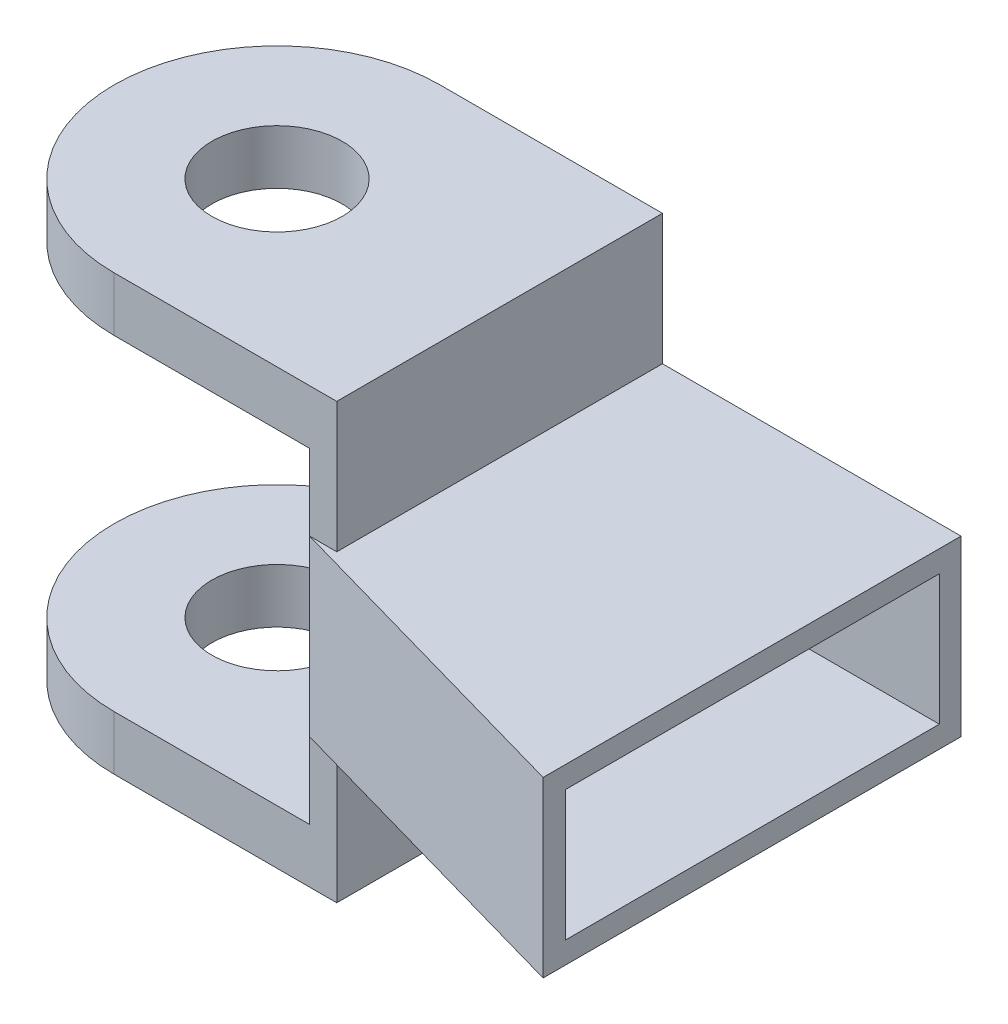
ISO-10303-21;
HEADER;
FILE_DESCRIPTION(('STEP AP214'),'2;1');
FILE_NAME('part.step','',(''),(''),'','','');
FILE_SCHEMA(('AUTOMOTIVE_DESIGN { 1 0 10303 214 1 1 1 1 }'));
ENDSEC;
DATA;
#1=APPLICATION_CONTEXT('core data for automotive mechanical design processes');
#2=APPLICATION_PROTOCOL_DEFINITION('international standard','automotive_design',2000,#1);
#3=PRODUCT_CONTEXT('',#1,'mechanical');
#4=PRODUCT('Part','Part','',(#3));
#5=PRODUCT_RELATED_PRODUCT_CATEGORY('part','',(#4));
#6=PRODUCT_DEFINITION_FORMATION('','',#4);
#7=PRODUCT_DEFINITION_CONTEXT('part definition',#1,'design');
#8=PRODUCT_DEFINITION('design','',#6,#7);
#9=PRODUCT_DEFINITION_SHAPE('','',#8);
#10=(LENGTH_UNIT() NAMED_UNIT(*) SI_UNIT(.MILLI.,.METRE.));
#11=(NAMED_UNIT(*) PLANE_ANGLE_UNIT() SI_UNIT($,.RADIAN.));
#12=(NAMED_UNIT(*) SI_UNIT($,.STERADIAN.) SOLID_ANGLE_UNIT());
#13=UNCERTAINTY_MEASURE_WITH_UNIT(LENGTH_MEASURE(1.E-05),#10,'distance_accuracy_value','');
#14=(GEOMETRIC_REPRESENTATION_CONTEXT(3) GLOBAL_UNCERTAINTY_ASSIGNED_CONTEXT((#13)) GLOBAL_UNIT_ASSIGNED_CONTEXT((#10,
#11,#12)) REPRESENTATION_CONTEXT('',''));
#15=CARTESIAN_POINT('',(0.,0.,0.));
#16=DIRECTION('',(0.,0.,1.));
#17=DIRECTION('',(1.,0.,0.));
#18=AXIS2_PLACEMENT_3D('',#15,#16,#17);
#19=CARTESIAN_POINT('',(-350.,16.,-31.0082296544966));
#20=DIRECTION('',(1.,0.,0.));
#21=DIRECTION('',(0.,0.,-1.));
#22=AXIS2_PLACEMENT_3D('',#19,#20,#21);
#23=PLANE('',#22);
#24=DIRECTION('',(0.,0.,-1.));
#25=VECTOR('',#24,1.);
#26=CARTESIAN_POINT('',(-350.,-7.,0.));
#27=LINE('',#26,#25);
#28=CARTESIAN_POINT('',(-350.,-7.,-31.0082296544966));
#29=VERTEX_POINT('',#28);
#30=CARTESIAN_POINT('',(-350.,-7.,-61.0082296544966));
#31=VERTEX_POINT('',#30);
#32=EDGE_CURVE('E175',#29,#31,#27,.T.);
#33=ORIENTED_EDGE('',*,*,#32,.F.);
#34=DIRECTION('',(0.,-1.,0.));
#35=VECTOR('',#34,1.);
#36=CARTESIAN_POINT('',(-350.,-12.,-31.0082296544966));
#37=LINE('',#36,#35);
#38=CARTESIAN_POINT('',(-350.,0.,-31.0082296544966));
#39=VERTEX_POINT('',#38);
#40=EDGE_CURVE('E190',#39,#29,#37,.T.);
#41=ORIENTED_EDGE('',*,*,#40,.F.);
#42=DIRECTION('',(0.,-1.,0.));
#43=VECTOR('',#42,1.);
#44=CARTESIAN_POINT('',(-350.,16.,-31.0082296544966));
#45=LINE('',#44,#43);
#46=CARTESIAN_POINT('',(-350.,16.,-31.0082296544966));
#47=VERTEX_POINT('',#46);
#48=EDGE_CURVE('E11',#47,#39,#45,.T.);
#49=ORIENTED_EDGE('',*,*,#48,.F.);
#50=DIRECTION('',(0.,1.,0.));
#51=VECTOR('',#50,1.);
#52=CARTESIAN_POINT('',(-350.,28.,-31.0082296544966));
#53=LINE('',#52,#51);
#54=CARTESIAN_POINT('',(-350.,23.,-31.0082296544966));
#55=VERTEX_POINT('',#54);
#56=EDGE_CURVE('E264',#47,#55,#53,.T.);
#57=ORIENTED_EDGE('',*,*,#56,.T.);
#58=DIRECTION('',(0.,0.,-1.));
#59=VECTOR('',#58,1.);
#60=CARTESIAN_POINT('',(-350.,23.,-61.0082296544966));
#61=LINE('',#60,#59);
#62=CARTESIAN_POINT('',(-350.,23.,-61.0082296544966));
#63=VERTEX_POINT('',#62);
#64=EDGE_CURVE('E238',#55,#63,#61,.T.);
#65=ORIENTED_EDGE('',*,*,#64,.T.);
#66=DIRECTION('',(0.,-1.,0.));
#67=VECTOR('',#66,1.);
#68=CARTESIAN_POINT('',(-350.,16.,-61.0082296544966));
#69=LINE('',#68,#67);
#70=EDGE_CURVE('E350',#63,#31,#69,.T.);
#71=ORIENTED_EDGE('',*,*,#70,.T.);
#72=EDGE_LOOP('',(#33,#41,#49,#57,#65,#71));
#73=FACE_BOUND('',#72,.T.);
#74=ADVANCED_FACE('F41',(#73),#23,.F.);
#75=CARTESIAN_POINT('',(-320.,16.,-61.0082296544966));
#76=DIRECTION('',(-1.,0.,0.));
#77=DIRECTION('',(0.,0.,1.));
#78=AXIS2_PLACEMENT_3D('',#75,#76,#77);
#79=PLANE('',#78);
#80=DIRECTION('',(0.,0.,-1.));
#81=VECTOR('',#80,1.);
#82=CARTESIAN_POINT('',(-320.,0.,-61.0082296544966));
#83=LINE('',#82,#81);
#84=CARTESIAN_POINT('',(-320.,0.,-22.5144026413586));
#85=VERTEX_POINT('',#84);
#86=CARTESIAN_POINT('',(-320.,0.,-61.0082296544966));
#87=VERTEX_POINT('',#86);
#88=EDGE_CURVE('E353',#85,#87,#83,.T.);
#89=ORIENTED_EDGE('',*,*,#88,.T.);
#90=DIRECTION('',(0.,-1.,0.));
#91=VECTOR('',#90,1.);
#92=CARTESIAN_POINT('',(-320.,16.,-61.0082296544966));
#93=LINE('',#92,#91);
#94=CARTESIAN_POINT('',(-320.,16.,-61.0082296544966));
#95=VERTEX_POINT('',#94);
#96=EDGE_CURVE('E361',#95,#87,#93,.T.);
#97=ORIENTED_EDGE('',*,*,#96,.F.);
#98=DIRECTION('',(0.,0.,-1.));
#99=VECTOR('',#98,1.);
#100=CARTESIAN_POINT('',(-320.,16.,-61.0082296544966));
#101=LINE('',#100,#99);
#102=CARTESIAN_POINT('',(-320.,16.,-22.5144026413586));
#103=VERTEX_POINT('',#102);
#104=EDGE_CURVE('E342',#103,#95,#101,.T.);
#105=ORIENTED_EDGE('',*,*,#104,.F.);
#106=DIRECTION('',(0.,-1.,0.));
#107=VECTOR('',#106,1.);
#108=CARTESIAN_POINT('',(-320.,16.,-22.5144026413586));
#109=LINE('',#108,#107);
#110=EDGE_CURVE('E49',#103,#85,#109,.T.);
#111=ORIENTED_EDGE('',*,*,#110,.T.);
#112=EDGE_LOOP('',(#89,#97,#105,#111));
#113=FACE_BOUND('',#112,.T.);
#114=DIRECTION('',(0.,0.,-1.));
#115=VECTOR('',#114,1.);
#116=CARTESIAN_POINT('',(-320.,2.,0.));
#117=LINE('',#116,#115);
#118=CARTESIAN_POINT('',(-320.,2.,-24.5930187379522));
#119=VERTEX_POINT('',#118);
#120=CARTESIAN_POINT('',(-320.,2.,-59.0082296544966));
#121=VERTEX_POINT('',#120);
#122=EDGE_CURVE('E319',#119,#121,#117,.T.);
#123=ORIENTED_EDGE('',*,*,#122,.F.);
#124=DIRECTION('',(0.,-1.,0.));
#125=VECTOR('',#124,1.);
#126=CARTESIAN_POINT('',(-320.,16.,-24.5930187379522));
#127=LINE('',#126,#125);
#128=CARTESIAN_POINT('',(-320.,14.,-24.5930187379522));
#129=VERTEX_POINT('',#128);
#130=EDGE_CURVE('E304',#129,#119,#127,.T.);
#131=ORIENTED_EDGE('',*,*,#130,.F.);
#132=DIRECTION('',(0.,0.,-1.));
#133=VECTOR('',#132,1.);
#134=CARTESIAN_POINT('',(-320.,14.,0.));
#135=LINE('',#134,#133);
#136=CARTESIAN_POINT('',(-320.,14.,-59.0082296544966));
#137=VERTEX_POINT('',#136);
#138=EDGE_CURVE('E323',#129,#137,#135,.T.);
#139=ORIENTED_EDGE('',*,*,#138,.T.);
#140=DIRECTION('',(0.,-1.,0.));
#141=VECTOR('',#140,1.);
#142=CARTESIAN_POINT('',(-320.,16.,-59.0082296544966));
#143=LINE('',#142,#141);
#144=EDGE_CURVE('E315',#137,#121,#143,.T.);
#145=ORIENTED_EDGE('',*,*,#144,.T.);
#146=EDGE_LOOP('',(#123,#131,#139,#145));
#147=FACE_BOUND('',#146,.T.);
#148=ADVANCED_FACE('F370',(#113,#147),#79,.F.);
#149=CARTESIAN_POINT('',(-350.,16.,-31.0082296544966));
#150=DIRECTION('',(0.272419296250593,0.,-0.962178635717054));
#151=DIRECTION('',(-0.962178635717054,0.,-0.272419296250593));
#152=AXIS2_PLACEMENT_3D('',#149,#150,#151);
#153=PLANE('',#152);
#154=DIRECTION('',(0.962178635717054,0.,0.272419296250593));
#155=VECTOR('',#154,1.);
#156=CARTESIAN_POINT('',(-350.,0.,-31.0082296544966));
#157=LINE('',#156,#155);
#158=EDGE_CURVE('E303',#39,#85,#157,.T.);
#159=ORIENTED_EDGE('',*,*,#158,.T.);
#160=ORIENTED_EDGE('',*,*,#110,.F.);
#161=DIRECTION('',(0.962178635717054,0.,0.272419296250593));
#162=VECTOR('',#161,1.);
#163=CARTESIAN_POINT('',(-350.,16.,-31.0082296544966));
#164=LINE('',#163,#162);
#165=EDGE_CURVE('E339',#47,#103,#164,.T.);
#166=ORIENTED_EDGE('',*,*,#165,.F.);
#167=ORIENTED_EDGE('',*,*,#48,.T.);
#168=EDGE_LOOP('',(#159,#160,#166,#167));
#169=FACE_BOUND('',#168,.T.);
#170=ADVANCED_FACE('F411',(#169),#153,.F.);
#171=CARTESIAN_POINT('',(-350.,16.,-61.0082296544966));
#172=DIRECTION('',(0.,0.,1.));
#173=DIRECTION('',(1.,0.,0.));
#174=AXIS2_PLACEMENT_3D('',#171,#172,#173);
#175=PLANE('',#174);
#176=DIRECTION('',(-1.,0.,0.));
#177=VECTOR('',#176,1.);
#178=CARTESIAN_POINT('',(-350.,0.,-61.0082296544966));
#179=LINE('',#178,#177);
#180=CARTESIAN_POINT('',(-347.5,0.,-61.0082296544966));
#181=VERTEX_POINT('',#180);
#182=EDGE_CURVE('E343',#87,#181,#179,.T.);
#183=ORIENTED_EDGE('',*,*,#182,.T.);
#184=DIRECTION('',(0.,1.,0.));
#185=VECTOR('',#184,1.);
#186=CARTESIAN_POINT('',(-347.5,0.,-61.0082296544966));
#187=LINE('',#186,#185);
#188=CARTESIAN_POINT('',(-347.5,-12.,-61.0082296544966));
#189=VERTEX_POINT('',#188);
#190=EDGE_CURVE('E212',#189,#181,#187,.T.);
#191=ORIENTED_EDGE('',*,*,#190,.F.);
#192=DIRECTION('',(-1.,0.,0.));
#193=VECTOR('',#192,1.);
#194=CARTESIAN_POINT('',(-347.5,-12.,-61.0082296544966));
#195=LINE('',#194,#193);
#196=CARTESIAN_POINT('',(-368.,-12.,-61.0082296544966));
#197=VERTEX_POINT('',#196);
#198=EDGE_CURVE('E222',#189,#197,#195,.T.);
#199=ORIENTED_EDGE('',*,*,#198,.T.);
#200=DIRECTION('',(0.,-1.,0.));
#201=VECTOR('',#200,1.);
#202=CARTESIAN_POINT('',(-368.,-7.,-61.0082296544966));
#203=LINE('',#202,#201);
#204=CARTESIAN_POINT('',(-368.,-7.,-61.0082296544966));
#205=VERTEX_POINT('',#204);
#206=EDGE_CURVE('E174',#205,#197,#203,.T.);
#207=ORIENTED_EDGE('',*,*,#206,.F.);
#208=DIRECTION('',(-1.,0.,0.));
#209=VECTOR('',#208,1.);
#210=CARTESIAN_POINT('',(0.,-7.,-61.0082296544966));
#211=LINE('',#210,#209);
#212=EDGE_CURVE('E182',#31,#205,#211,.T.);
#213=ORIENTED_EDGE('',*,*,#212,.F.);
#214=ORIENTED_EDGE('',*,*,#70,.F.);
#215=DIRECTION('',(-1.,0.,0.));
#216=VECTOR('',#215,1.);
#217=CARTESIAN_POINT('',(-350.,23.,-61.0082296544966));
#218=LINE('',#217,#216);
#219=CARTESIAN_POINT('',(-368.,23.,-61.0082296544966));
#220=VERTEX_POINT('',#219);
#221=EDGE_CURVE('E64',#63,#220,#218,.T.);
#222=ORIENTED_EDGE('',*,*,#221,.T.);
#223=DIRECTION('',(0.,-1.,0.));
#224=VECTOR('',#223,1.);
#225=CARTESIAN_POINT('',(-368.,28.,-61.0082296544966));
#226=LINE('',#225,#224);
#227=CARTESIAN_POINT('',(-368.,28.,-61.0082296544966));
#228=VERTEX_POINT('',#227);
#229=EDGE_CURVE('E260',#228,#220,#226,.T.);
#230=ORIENTED_EDGE('',*,*,#229,.F.);
#231=DIRECTION('',(-1.,0.,0.));
#232=VECTOR('',#231,1.);
#233=CARTESIAN_POINT('',(-347.5,28.,-61.0082296544966));
#234=LINE('',#233,#232);
#235=CARTESIAN_POINT('',(-347.5,28.,-61.0082296544966));
#236=VERTEX_POINT('',#235);
#237=EDGE_CURVE('E285',#236,#228,#234,.T.);
#238=ORIENTED_EDGE('',*,*,#237,.F.);
#239=DIRECTION('',(0.,-1.,0.));
#240=VECTOR('',#239,1.);
#241=CARTESIAN_POINT('',(-347.5,16.,-61.0082296544966));
#242=LINE('',#241,#240);
#243=CARTESIAN_POINT('',(-347.5,16.,-61.0082296544966));
#244=VERTEX_POINT('',#243);
#245=EDGE_CURVE('E277',#236,#244,#242,.T.);
#246=ORIENTED_EDGE('',*,*,#245,.T.);
#247=DIRECTION('',(-1.,0.,0.));
#248=VECTOR('',#247,1.);
#249=CARTESIAN_POINT('',(-350.,16.,-61.0082296544966));
#250=LINE('',#249,#248);
#251=EDGE_CURVE('E346',#95,#244,#250,.T.);
#252=ORIENTED_EDGE('',*,*,#251,.F.);
#253=ORIENTED_EDGE('',*,*,#96,.T.);
#254=EDGE_LOOP('',(#183,#191,#199,#207,#213,#214,#222,#230,#238,#246,#252,#253));
#255=FACE_BOUND('',#254,.T.);
#256=ADVANCED_FACE('F378',(#255),#175,.F.);
#257=CARTESIAN_POINT('',(0.,16.,0.));
#258=DIRECTION('',(0.,-1.,0.));
#259=DIRECTION('',(0.,0.,-1.));
#260=AXIS2_PLACEMENT_3D('',#257,#258,#259);
#261=PLANE('',#260);
#262=ORIENTED_EDGE('',*,*,#251,.T.);
#263=DIRECTION('',(0.,0.,1.));
#264=VECTOR('',#263,1.);
#265=CARTESIAN_POINT('',(-347.5,16.,-31.0082296544966));
#266=LINE('',#265,#264);
#267=CARTESIAN_POINT('',(-347.5,16.,-31.0082296544966));
#268=VERTEX_POINT('',#267);
#269=EDGE_CURVE('E265',#244,#268,#266,.T.);
#270=ORIENTED_EDGE('',*,*,#269,.T.);
#271=DIRECTION('',(-1.,0.,0.));
#272=VECTOR('',#271,1.);
#273=CARTESIAN_POINT('',(-347.5,16.,-31.0082296544966));
#274=LINE('',#273,#272);
#275=EDGE_CURVE('E281',#268,#47,#274,.T.);
#276=ORIENTED_EDGE('',*,*,#275,.T.);
#277=ORIENTED_EDGE('',*,*,#165,.T.);
#278=ORIENTED_EDGE('',*,*,#104,.T.);
#279=EDGE_LOOP('',(#262,#270,#276,#277,#278));
#280=FACE_BOUND('',#279,.T.);
#281=ADVANCED_FACE('F410',(#280),#261,.F.);
#282=CARTESIAN_POINT('',(0.,0.,0.));
#283=DIRECTION('',(0.,-1.,0.));
#284=DIRECTION('',(0.,0.,-1.));
#285=AXIS2_PLACEMENT_3D('',#282,#283,#284);
#286=PLANE('',#285);
#287=DIRECTION('',(-1.,0.,0.));
#288=VECTOR('',#287,1.);
#289=CARTESIAN_POINT('',(-347.5,0.,-31.0082296544966));
#290=LINE('',#289,#288);
#291=CARTESIAN_POINT('',(-347.5,0.,-31.0082296544966));
#292=VERTEX_POINT('',#291);
#293=EDGE_CURVE('E225',#292,#39,#290,.T.);
#294=ORIENTED_EDGE('',*,*,#293,.F.);
#295=DIRECTION('',(0.,0.,1.));
#296=VECTOR('',#295,1.);
#297=CARTESIAN_POINT('',(-347.5,0.,-31.0082296544966));
#298=LINE('',#297,#296);
#299=EDGE_CURVE('E56',#181,#292,#298,.T.);
#300=ORIENTED_EDGE('',*,*,#299,.F.);
#301=ORIENTED_EDGE('',*,*,#182,.F.);
#302=ORIENTED_EDGE('',*,*,#88,.F.);
#303=ORIENTED_EDGE('',*,*,#158,.F.);
#304=EDGE_LOOP('',(#294,#300,#301,#302,#303));
#305=FACE_BOUND('',#304,.T.);
#306=ADVANCED_FACE('F375',(#305),#286,.T.);
#307=CARTESIAN_POINT('',(-348.,16.,-31.0082296544966));
#308=DIRECTION('',(1.,0.,0.));
#309=DIRECTION('',(0.,0.,-1.));
#310=AXIS2_PLACEMENT_3D('',#307,#308,#309);
#311=PLANE('',#310);
#312=DIRECTION('',(0.,0.,1.));
#313=VECTOR('',#312,1.);
#314=CARTESIAN_POINT('',(-348.,2.,0.));
#315=LINE('',#314,#313);
#316=CARTESIAN_POINT('',(-348.,2.,-59.0082296544966));
#317=VERTEX_POINT('',#316);
#318=CARTESIAN_POINT('',(-348.,2.,-32.520590616881));
#319=VERTEX_POINT('',#318);
#320=EDGE_CURVE('E288',#317,#319,#315,.T.);
#321=ORIENTED_EDGE('',*,*,#320,.F.);
#322=DIRECTION('',(0.,-1.,0.));
#323=VECTOR('',#322,1.);
#324=CARTESIAN_POINT('',(-348.,16.,-59.0082296544966));
#325=LINE('',#324,#323);
#326=CARTESIAN_POINT('',(-348.,14.,-59.0082296544966));
#327=VERTEX_POINT('',#326);
#328=EDGE_CURVE('E311',#327,#317,#325,.T.);
#329=ORIENTED_EDGE('',*,*,#328,.F.);
#330=DIRECTION('',(0.,0.,1.));
#331=VECTOR('',#330,1.);
#332=CARTESIAN_POINT('',(-348.,14.,0.));
#333=LINE('',#332,#331);
#334=CARTESIAN_POINT('',(-348.,14.,-32.520590616881));
#335=VERTEX_POINT('',#334);
#336=EDGE_CURVE('E305',#327,#335,#333,.T.);
#337=ORIENTED_EDGE('',*,*,#336,.T.);
#338=DIRECTION('',(0.,-1.,0.));
#339=VECTOR('',#338,1.);
#340=CARTESIAN_POINT('',(-348.,16.,-32.520590616881));
#341=LINE('',#340,#339);
#342=EDGE_CURVE('E299',#335,#319,#341,.T.);
#343=ORIENTED_EDGE('',*,*,#342,.T.);
#344=EDGE_LOOP('',(#321,#329,#337,#343));
#345=FACE_BOUND('',#344,.T.);
#346=ADVANCED_FACE('F435',(#345),#311,.T.);
#347=CARTESIAN_POINT('',(-349.455161407499,16.,-32.9325869259307));
#348=DIRECTION('',(0.272419296250593,0.,-0.962178635717054));
#349=DIRECTION('',(-0.962178635717054,0.,-0.272419296250593));
#350=AXIS2_PLACEMENT_3D('',#347,#348,#349);
#351=PLANE('',#350);
#352=DIRECTION('',(0.962178635717054,0.,0.272419296250593));
#353=VECTOR('',#352,1.);
#354=CARTESIAN_POINT('',(-17.3017029914529,2.,61.1092136607835));
#355=LINE('',#354,#353);
#356=EDGE_CURVE('E298',#319,#119,#355,.T.);
#357=ORIENTED_EDGE('',*,*,#356,.F.);
#358=ORIENTED_EDGE('',*,*,#342,.F.);
#359=DIRECTION('',(0.962178635717054,0.,0.272419296250593));
#360=VECTOR('',#359,1.);
#361=CARTESIAN_POINT('',(-17.3017029914529,14.,61.1092136607835));
#362=LINE('',#361,#360);
#363=EDGE_CURVE('E309',#335,#129,#362,.T.);
#364=ORIENTED_EDGE('',*,*,#363,.T.);
#365=ORIENTED_EDGE('',*,*,#130,.T.);
#366=EDGE_LOOP('',(#357,#358,#364,#365));
#367=FACE_BOUND('',#366,.T.);
#368=ADVANCED_FACE('F439',(#367),#351,.T.);
#369=CARTESIAN_POINT('',(-350.,16.,-59.0082296544966));
#370=DIRECTION('',(0.,0.,1.));
#371=DIRECTION('',(1.,0.,0.));
#372=AXIS2_PLACEMENT_3D('',#369,#370,#371);
#373=PLANE('',#372);
#374=DIRECTION('',(-1.,0.,0.));
#375=VECTOR('',#374,1.);
#376=CARTESIAN_POINT('',(0.,2.,-59.0082296544966));
#377=LINE('',#376,#375);
#378=EDGE_CURVE('E310',#121,#317,#377,.T.);
#379=ORIENTED_EDGE('',*,*,#378,.F.);
#380=ORIENTED_EDGE('',*,*,#144,.F.);
#381=DIRECTION('',(-1.,0.,0.));
#382=VECTOR('',#381,1.);
#383=CARTESIAN_POINT('',(0.,14.,-59.0082296544966));
#384=LINE('',#383,#382);
#385=EDGE_CURVE('E316',#137,#327,#384,.T.);
#386=ORIENTED_EDGE('',*,*,#385,.T.);
#387=ORIENTED_EDGE('',*,*,#328,.T.);
#388=EDGE_LOOP('',(#379,#380,#386,#387));
#389=FACE_BOUND('',#388,.T.);
#390=ADVANCED_FACE('F450',(#389),#373,.T.);
#391=CARTESIAN_POINT('',(0.,14.,0.));
#392=DIRECTION('',(0.,-1.,0.));
#393=DIRECTION('',(0.,0.,-1.));
#394=AXIS2_PLACEMENT_3D('',#391,#392,#393);
#395=PLANE('',#394);
#396=ORIENTED_EDGE('',*,*,#336,.F.);
#397=ORIENTED_EDGE('',*,*,#385,.F.);
#398=ORIENTED_EDGE('',*,*,#138,.F.);
#399=ORIENTED_EDGE('',*,*,#363,.F.);
#400=EDGE_LOOP('',(#396,#397,#398,#399));
#401=FACE_BOUND('',#400,.T.);
#402=ADVANCED_FACE('F460',(#401),#395,.T.);
#403=CARTESIAN_POINT('',(0.,2.,0.));
#404=DIRECTION('',(0.,-1.,0.));
#405=DIRECTION('',(0.,0.,-1.));
#406=AXIS2_PLACEMENT_3D('',#403,#404,#405);
#407=PLANE('',#406);
#408=ORIENTED_EDGE('',*,*,#320,.T.);
#409=ORIENTED_EDGE('',*,*,#356,.T.);
#410=ORIENTED_EDGE('',*,*,#122,.T.);
#411=ORIENTED_EDGE('',*,*,#378,.T.);
#412=EDGE_LOOP('',(#408,#409,#410,#411));
#413=FACE_BOUND('',#412,.T.);
#414=ADVANCED_FACE('F470',(#413),#407,.F.);
#415=CARTESIAN_POINT('',(-347.5,28.,-61.0082296544966));
#416=DIRECTION('',(0.,1.,0.));
#417=DIRECTION('',(0.,0.,1.));
#418=AXIS2_PLACEMENT_3D('',#415,#416,#417);
#419=PLANE('',#418);
#420=ORIENTED_EDGE('',*,*,#237,.T.);
#421=CARTESIAN_POINT('',(-368.,28.,-46.0082296544966));
#422=DIRECTION('',(0.,1.,0.));
#423=DIRECTION('',(0.,0.,1.));
#424=AXIS2_PLACEMENT_3D('',#421,#422,#423);
#425=CIRCLE('',#424,15.);
#426=CARTESIAN_POINT('',(-368.,28.,-31.0082296544966));
#427=VERTEX_POINT('',#426);
#428=EDGE_CURVE('E242',#228,#427,#425,.T.);
#429=ORIENTED_EDGE('',*,*,#428,.T.);
#430=DIRECTION('',(-1.,0.,0.));
#431=VECTOR('',#430,1.);
#432=CARTESIAN_POINT('',(-347.5,28.,-31.0082296544966));
#433=LINE('',#432,#431);
#434=CARTESIAN_POINT('',(-347.5,28.,-31.0082296544966));
#435=VERTEX_POINT('',#434);
#436=EDGE_CURVE('E289',#435,#427,#433,.T.);
#437=ORIENTED_EDGE('',*,*,#436,.F.);
#438=DIRECTION('',(0.,0.,-1.));
#439=VECTOR('',#438,1.);
#440=CARTESIAN_POINT('',(-347.5,28.,-61.0082296544966));
#441=LINE('',#440,#439);
#442=EDGE_CURVE('E273',#435,#236,#441,.T.);
#443=ORIENTED_EDGE('',*,*,#442,.T.);
#444=EDGE_LOOP('',(#420,#429,#437,#443));
#445=FACE_BOUND('',#444,.T.);
#446=CARTESIAN_POINT('',(-368.,28.,-46.0082296544966));
#447=DIRECTION('',(0.,1.,0.));
#448=DIRECTION('',(0.,0.,1.));
#449=AXIS2_PLACEMENT_3D('',#446,#447,#448);
#450=CIRCLE('',#449,5.99999999999999);
#451=CARTESIAN_POINT('',(-368.,28.,-40.0082296544966));
#452=VERTEX_POINT('',#451);
#453=EDGE_CURVE('E234',#452,#452,#450,.T.);
#454=ORIENTED_EDGE('',*,*,#453,.F.);
#455=EDGE_LOOP('',(#454));
#456=FACE_BOUND('',#455,.T.);
#457=ADVANCED_FACE('F404',(#445,#456),#419,.T.);
#458=CARTESIAN_POINT('',(-347.5,28.,-31.0082296544966));
#459=DIRECTION('',(0.,0.,1.));
#460=DIRECTION('',(0.,-1.,0.));
#461=AXIS2_PLACEMENT_3D('',#458,#459,#460);
#462=PLANE('',#461);
#463=ORIENTED_EDGE('',*,*,#56,.F.);
#464=ORIENTED_EDGE('',*,*,#275,.F.);
#465=DIRECTION('',(0.,1.,0.));
#466=VECTOR('',#465,1.);
#467=CARTESIAN_POINT('',(-347.5,28.,-31.0082296544966));
#468=LINE('',#467,#466);
#469=EDGE_CURVE('E269',#268,#435,#468,.T.);
#470=ORIENTED_EDGE('',*,*,#469,.T.);
#471=ORIENTED_EDGE('',*,*,#436,.T.);
#472=DIRECTION('',(0.,-1.,0.));
#473=VECTOR('',#472,1.);
#474=CARTESIAN_POINT('',(-368.,28.,-31.0082296544966));
#475=LINE('',#474,#473);
#476=CARTESIAN_POINT('',(-368.,23.,-31.0082296544966));
#477=VERTEX_POINT('',#476);
#478=EDGE_CURVE('E246',#427,#477,#475,.T.);
#479=ORIENTED_EDGE('',*,*,#478,.T.);
#480=DIRECTION('',(1.,0.,0.));
#481=VECTOR('',#480,1.);
#482=CARTESIAN_POINT('',(-350.,23.,-31.0082296544966));
#483=LINE('',#482,#481);
#484=EDGE_CURVE('E247',#477,#55,#483,.T.);
#485=ORIENTED_EDGE('',*,*,#484,.T.);
#486=EDGE_LOOP('',(#463,#464,#470,#471,#479,#485));
#487=FACE_BOUND('',#486,.T.);
#488=ADVANCED_FACE('F395',(#487),#462,.T.);
#489=CARTESIAN_POINT('',(-347.5,0.,0.));
#490=DIRECTION('',(1.,0.,0.));
#491=DIRECTION('',(0.,0.,-1.));
#492=AXIS2_PLACEMENT_3D('',#489,#490,#491);
#493=PLANE('',#492);
#494=ORIENTED_EDGE('',*,*,#269,.F.);
#495=ORIENTED_EDGE('',*,*,#245,.F.);
#496=ORIENTED_EDGE('',*,*,#442,.F.);
#497=ORIENTED_EDGE('',*,*,#469,.F.);
#498=EDGE_LOOP('',(#494,#495,#496,#497));
#499=FACE_BOUND('',#498,.T.);
#500=ADVANCED_FACE('F408',(#499),#493,.T.);
#501=CARTESIAN_POINT('',(-368.,23.,-46.0082296544966));
#502=DIRECTION('',(0.,1.,0.));
#503=DIRECTION('',(0.,0.,1.));
#504=AXIS2_PLACEMENT_3D('',#501,#502,#503);
#505=PLANE('',#504);
#506=ORIENTED_EDGE('',*,*,#64,.F.);
#507=ORIENTED_EDGE('',*,*,#484,.F.);
#508=CARTESIAN_POINT('',(-368.,23.,-46.0082296544966));
#509=DIRECTION('',(0.,1.,0.));
#510=DIRECTION('',(0.,0.,1.));
#511=AXIS2_PLACEMENT_3D('',#508,#509,#510);
#512=CIRCLE('',#511,15.);
#513=EDGE_CURVE('E252',#220,#477,#512,.T.);
#514=ORIENTED_EDGE('',*,*,#513,.F.);
#515=ORIENTED_EDGE('',*,*,#221,.F.);
#516=EDGE_LOOP('',(#506,#507,#514,#515));
#517=FACE_BOUND('',#516,.T.);
#518=CARTESIAN_POINT('',(-368.,23.,-46.0082296544966));
#519=DIRECTION('',(0.,1.,0.));
#520=DIRECTION('',(0.,0.,1.));
#521=AXIS2_PLACEMENT_3D('',#518,#519,#520);
#522=CIRCLE('',#521,5.99999999999999);
#523=CARTESIAN_POINT('',(-368.,23.,-40.0082296544966));
#524=VERTEX_POINT('',#523);
#525=EDGE_CURVE('E228',#524,#524,#522,.T.);
#526=ORIENTED_EDGE('',*,*,#525,.T.);
#527=EDGE_LOOP('',(#526));
#528=FACE_BOUND('',#527,.T.);
#529=ADVANCED_FACE('F392',(#517,#528),#505,.F.);
#530=CARTESIAN_POINT('',(-368.,28.,-46.0082296544966));
#531=DIRECTION('',(0.,-1.,0.));
#532=DIRECTION('',(0.,0.,-1.));
#533=AXIS2_PLACEMENT_3D('',#530,#531,#532);
#534=CYLINDRICAL_SURFACE('',#533,15.);
#535=ORIENTED_EDGE('',*,*,#513,.T.);
#536=ORIENTED_EDGE('',*,*,#478,.F.);
#537=ORIENTED_EDGE('',*,*,#428,.F.);
#538=ORIENTED_EDGE('',*,*,#229,.T.);
#539=EDGE_LOOP('',(#535,#536,#537,#538));
#540=FACE_BOUND('',#539,.T.);
#541=ADVANCED_FACE('F399',(#540),#534,.T.);
#542=CARTESIAN_POINT('',(-368.,28.,-46.0082296544966));
#543=DIRECTION('',(0.,-1.,0.));
#544=DIRECTION('',(0.,0.,-1.));
#545=AXIS2_PLACEMENT_3D('',#542,#543,#544);
#546=CYLINDRICAL_SURFACE('',#545,5.99999999999999);
#547=ORIENTED_EDGE('',*,*,#453,.T.);
#548=EDGE_LOOP('',(#547));
#549=FACE_BOUND('',#548,.T.);
#550=ORIENTED_EDGE('',*,*,#525,.F.);
#551=EDGE_LOOP('',(#550));
#552=FACE_BOUND('',#551,.T.);
#553=ADVANCED_FACE('F534',(#549,#552),#546,.F.);
#554=CARTESIAN_POINT('',(-347.5,-12.,-31.0082296544966));
#555=DIRECTION('',(0.,0.,-1.));
#556=DIRECTION('',(0.,1.,0.));
#557=AXIS2_PLACEMENT_3D('',#554,#555,#556);
#558=PLANE('',#557);
#559=ORIENTED_EDGE('',*,*,#40,.T.);
#560=DIRECTION('',(-1.,0.,0.));
#561=VECTOR('',#560,1.);
#562=CARTESIAN_POINT('',(0.,-7.,-31.0082296544966));
#563=LINE('',#562,#561);
#564=CARTESIAN_POINT('',(-368.,-7.,-31.0082296544966));
#565=VERTEX_POINT('',#564);
#566=EDGE_CURVE('E180',#29,#565,#563,.T.);
#567=ORIENTED_EDGE('',*,*,#566,.T.);
#568=DIRECTION('',(0.,-1.,0.));
#569=VECTOR('',#568,1.);
#570=CARTESIAN_POINT('',(-368.,-7.,-31.0082296544966));
#571=LINE('',#570,#569);
#572=CARTESIAN_POINT('',(-368.,-12.,-31.0082296544966));
#573=VERTEX_POINT('',#572);
#574=EDGE_CURVE('E163',#565,#573,#571,.T.);
#575=ORIENTED_EDGE('',*,*,#574,.T.);
#576=DIRECTION('',(-1.,0.,0.));
#577=VECTOR('',#576,1.);
#578=CARTESIAN_POINT('',(-347.5,-12.,-31.0082296544966));
#579=LINE('',#578,#577);
#580=CARTESIAN_POINT('',(-347.5,-12.,-31.0082296544966));
#581=VERTEX_POINT('',#580);
#582=EDGE_CURVE('E229',#581,#573,#579,.T.);
#583=ORIENTED_EDGE('',*,*,#582,.F.);
#584=DIRECTION('',(0.,-1.,0.));
#585=VECTOR('',#584,1.);
#586=CARTESIAN_POINT('',(-347.5,-12.,-31.0082296544966));
#587=LINE('',#586,#585);
#588=EDGE_CURVE('E219',#292,#581,#587,.T.);
#589=ORIENTED_EDGE('',*,*,#588,.F.);
#590=ORIENTED_EDGE('',*,*,#293,.T.);
#591=EDGE_LOOP('',(#559,#567,#575,#583,#589,#590));
#592=FACE_BOUND('',#591,.T.);
#593=ADVANCED_FACE('F187',(#592),#558,.F.);
#594=CARTESIAN_POINT('',(-347.5,-12.,-61.0082296544966));
#595=DIRECTION('',(0.,1.,0.));
#596=DIRECTION('',(0.,0.,1.));
#597=AXIS2_PLACEMENT_3D('',#594,#595,#596);
#598=PLANE('',#597);
#599=ORIENTED_EDGE('',*,*,#582,.T.);
#600=CARTESIAN_POINT('',(-368.,-12.,-46.0082296544966));
#601=DIRECTION('',(0.,-1.,0.));
#602=DIRECTION('',(0.,0.,-1.));
#603=AXIS2_PLACEMENT_3D('',#600,#601,#602);
#604=CIRCLE('',#603,15.);
#605=EDGE_CURVE('E169',#573,#197,#604,.T.);
#606=ORIENTED_EDGE('',*,*,#605,.T.);
#607=ORIENTED_EDGE('',*,*,#198,.F.);
#608=DIRECTION('',(0.,0.,-1.));
#609=VECTOR('',#608,1.);
#610=CARTESIAN_POINT('',(-347.5,-12.,-61.0082296544966));
#611=LINE('',#610,#609);
#612=EDGE_CURVE('E216',#581,#189,#611,.T.);
#613=ORIENTED_EDGE('',*,*,#612,.F.);
#614=EDGE_LOOP('',(#599,#606,#607,#613));
#615=FACE_BOUND('',#614,.T.);
#616=CARTESIAN_POINT('',(-368.,-12.,-46.0082296544966));
#617=DIRECTION('',(0.,-1.,0.));
#618=DIRECTION('',(0.,0.,-1.));
#619=AXIS2_PLACEMENT_3D('',#616,#617,#618);
#620=CIRCLE('',#619,5.99999999999999);
#621=CARTESIAN_POINT('',(-368.,-12.,-52.0082296544966));
#622=VERTEX_POINT('',#621);
#623=EDGE_CURVE('E202',#622,#622,#620,.T.);
#624=ORIENTED_EDGE('',*,*,#623,.F.);
#625=EDGE_LOOP('',(#624));
#626=FACE_BOUND('',#625,.T.);
#627=ADVANCED_FACE('F386',(#615,#626),#598,.F.);
#628=CARTESIAN_POINT('',(-347.5,16.,0.));
#629=DIRECTION('',(1.,0.,0.));
#630=DIRECTION('',(0.,0.,-1.));
#631=AXIS2_PLACEMENT_3D('',#628,#629,#630);
#632=PLANE('',#631);
#633=ORIENTED_EDGE('',*,*,#299,.T.);
#634=ORIENTED_EDGE('',*,*,#588,.T.);
#635=ORIENTED_EDGE('',*,*,#612,.T.);
#636=ORIENTED_EDGE('',*,*,#190,.T.);
#637=EDGE_LOOP('',(#633,#634,#635,#636));
#638=FACE_BOUND('',#637,.T.);
#639=ADVANCED_FACE('F381',(#638),#632,.T.);
#640=CARTESIAN_POINT('',(-368.,-7.,-46.0082296544966));
#641=DIRECTION('',(0.,-1.,0.));
#642=DIRECTION('',(0.,0.,-1.));
#643=AXIS2_PLACEMENT_3D('',#640,#641,#642);
#644=CYLINDRICAL_SURFACE('',#643,5.99999999999999);
#645=CARTESIAN_POINT('',(-368.,-7.,-46.0082296544966));
#646=DIRECTION('',(0.,-1.,0.));
#647=DIRECTION('',(0.,0.,-1.));
#648=AXIS2_PLACEMENT_3D('',#645,#646,#647);
#649=CIRCLE('',#648,5.99999999999999);
#650=CARTESIAN_POINT('',(-368.,-7.,-52.0082296544966));
#651=VERTEX_POINT('',#650);
#652=EDGE_CURVE('E192',#651,#651,#649,.T.);
#653=ORIENTED_EDGE('',*,*,#652,.F.);
#654=EDGE_LOOP('',(#653));
#655=FACE_BOUND('',#654,.T.);
#656=ORIENTED_EDGE('',*,*,#623,.T.);
#657=EDGE_LOOP('',(#656));
#658=FACE_BOUND('',#657,.T.);
#659=ADVANCED_FACE('F562',(#655,#658),#644,.F.);
#660=CARTESIAN_POINT('',(-368.,-7.,-46.0082296544966));
#661=DIRECTION('',(0.,-1.,0.));
#662=DIRECTION('',(0.,0.,-1.));
#663=AXIS2_PLACEMENT_3D('',#660,#661,#662);
#664=CYLINDRICAL_SURFACE('',#663,15.);
#665=ORIENTED_EDGE('',*,*,#605,.F.);
#666=ORIENTED_EDGE('',*,*,#574,.F.);
#667=CARTESIAN_POINT('',(-368.,-7.,-46.0082296544966));
#668=DIRECTION('',(0.,-1.,0.));
#669=DIRECTION('',(0.,0.,-1.));
#670=AXIS2_PLACEMENT_3D('',#667,#668,#669);
#671=CIRCLE('',#670,15.);
#672=EDGE_CURVE('E167',#565,#205,#671,.T.);
#673=ORIENTED_EDGE('',*,*,#672,.T.);
#674=ORIENTED_EDGE('',*,*,#206,.T.);
#675=EDGE_LOOP('',(#665,#666,#673,#674));
#676=FACE_BOUND('',#675,.T.);
#677=ADVANCED_FACE('F165',(#676),#664,.T.);
#678=CARTESIAN_POINT('',(0.,-7.,0.));
#679=DIRECTION('',(0.,-1.,0.));
#680=DIRECTION('',(0.,0.,-1.));
#681=AXIS2_PLACEMENT_3D('',#678,#679,#680);
#682=PLANE('',#681);
#683=ORIENTED_EDGE('',*,*,#652,.T.);
#684=EDGE_LOOP('',(#683));
#685=FACE_BOUND('',#684,.T.);
#686=ORIENTED_EDGE('',*,*,#566,.F.);
#687=ORIENTED_EDGE('',*,*,#32,.T.);
#688=ORIENTED_EDGE('',*,*,#212,.T.);
#689=ORIENTED_EDGE('',*,*,#672,.F.);
#690=EDGE_LOOP('',(#686,#687,#688,#689));
#691=FACE_BOUND('',#690,.T.);
#692=ADVANCED_FACE('F178',(#685,#691),#682,.F.);
#693=CLOSED_SHELL('',(#74,#148,#170,#256,#281,#306,#346,#368,#390,#402,#414,#457,#488,#500,#529,
#541,#553,#593,#627,#639,#659,#677,#692));
#694=MANIFOLD_SOLID_BREP('B2',#693);
#695=ADVANCED_BREP_SHAPE_REPRESENTATION('',(#18,#694),#14);
#696=SHAPE_DEFINITION_REPRESENTATION(#9,#695);
ENDSEC;
END-ISO-10303-21;
